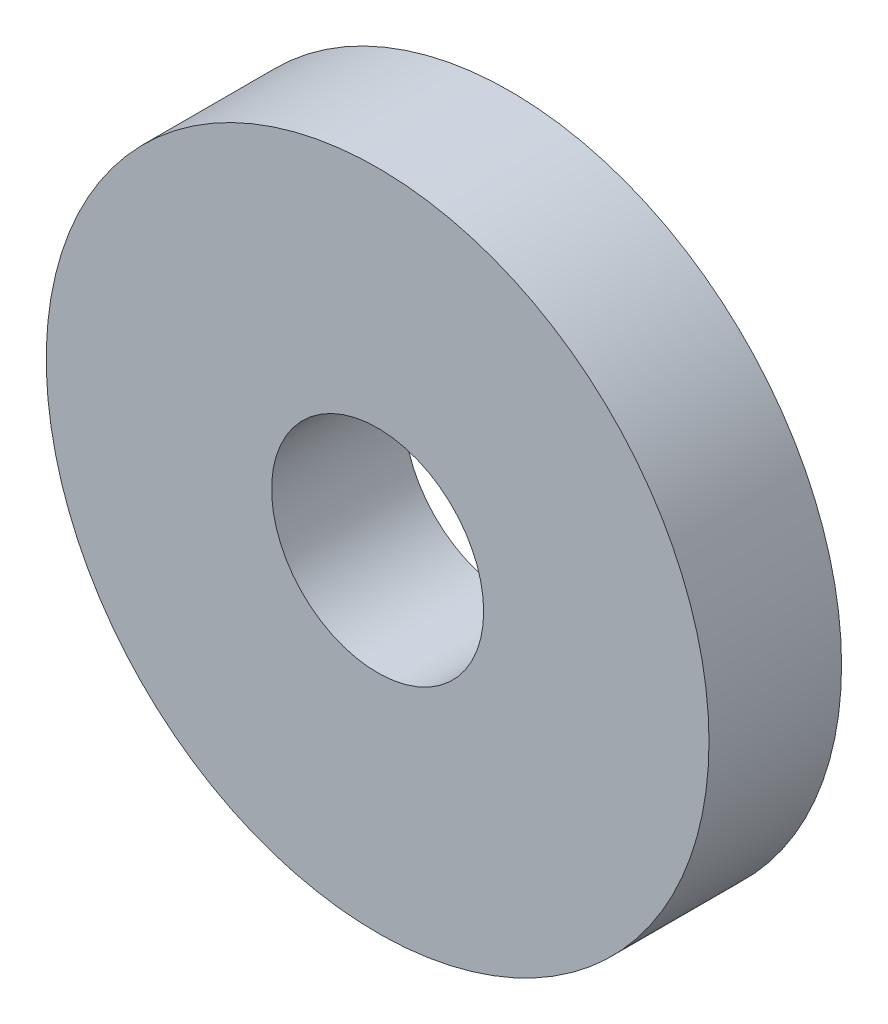
ISO-10303-21;
HEADER;
FILE_DESCRIPTION(('STEP AP214'),'2;1');
FILE_NAME('part.step','',(''),(''),'','','');
FILE_SCHEMA(('AUTOMOTIVE_DESIGN { 1 0 10303 214 1 1 1 1 }'));
ENDSEC;
DATA;
#1=APPLICATION_CONTEXT('core data for automotive mechanical design processes');
#2=APPLICATION_PROTOCOL_DEFINITION('international standard','automotive_design',2000,#1);
#3=PRODUCT_CONTEXT('',#1,'mechanical');
#4=PRODUCT('Part','Part','',(#3));
#5=PRODUCT_RELATED_PRODUCT_CATEGORY('part','',(#4));
#6=PRODUCT_DEFINITION_FORMATION('','',#4);
#7=PRODUCT_DEFINITION_CONTEXT('part definition',#1,'design');
#8=PRODUCT_DEFINITION('design','',#6,#7);
#9=PRODUCT_DEFINITION_SHAPE('','',#8);
#10=(LENGTH_UNIT() NAMED_UNIT(*) SI_UNIT(.MILLI.,.METRE.));
#11=(NAMED_UNIT(*) PLANE_ANGLE_UNIT() SI_UNIT($,.RADIAN.));
#12=(NAMED_UNIT(*) SI_UNIT($,.STERADIAN.) SOLID_ANGLE_UNIT());
#13=UNCERTAINTY_MEASURE_WITH_UNIT(LENGTH_MEASURE(1.E-05),#10,'distance_accuracy_value','');
#14=(GEOMETRIC_REPRESENTATION_CONTEXT(3) GLOBAL_UNCERTAINTY_ASSIGNED_CONTEXT((#13)) GLOBAL_UNIT_ASSIGNED_CONTEXT((#10,
#11,#12)) REPRESENTATION_CONTEXT('',''));
#15=CARTESIAN_POINT('',(0.,0.,0.));
#16=DIRECTION('',(0.,0.,1.));
#17=DIRECTION('',(1.,0.,0.));
#18=AXIS2_PLACEMENT_3D('',#15,#16,#17);
#19=CARTESIAN_POINT('',(0.,0.,5.));
#20=DIRECTION('',(0.,0.,1.));
#21=DIRECTION('',(1.,0.,0.));
#22=AXIS2_PLACEMENT_3D('',#19,#20,#21);
#23=PLANE('',#22);
#24=CARTESIAN_POINT('',(0.,0.,5.));
#25=DIRECTION('',(0.,0.,1.));
#26=DIRECTION('',(1.,0.,0.));
#27=AXIS2_PLACEMENT_3D('',#24,#25,#26);
#28=CIRCLE('',#27,12.5);
#29=CARTESIAN_POINT('',(12.5,0.,5.));
#30=VERTEX_POINT('',#29);
#31=EDGE_CURVE('E10',#30,#30,#28,.T.);
#32=ORIENTED_EDGE('',*,*,#31,.T.);
#33=EDGE_LOOP('',(#32));
#34=FACE_BOUND('',#33,.T.);
#35=CARTESIAN_POINT('',(0.,0.,5.));
#36=DIRECTION('',(0.,0.,1.));
#37=DIRECTION('',(1.,0.,0.));
#38=AXIS2_PLACEMENT_3D('',#35,#36,#37);
#39=CIRCLE('',#38,4.);
#40=CARTESIAN_POINT('',(4.,0.,5.));
#41=VERTEX_POINT('',#40);
#42=EDGE_CURVE('E48',#41,#41,#39,.T.);
#43=ORIENTED_EDGE('',*,*,#42,.F.);
#44=EDGE_LOOP('',(#43));
#45=FACE_BOUND('',#44,.T.);
#46=ADVANCED_FACE('F40',(#34,#45),#23,.T.);
#47=CARTESIAN_POINT('',(0.,0.,0.));
#48=DIRECTION('',(0.,0.,1.));
#49=DIRECTION('',(1.,0.,0.));
#50=AXIS2_PLACEMENT_3D('',#47,#48,#49);
#51=PLANE('',#50);
#52=CARTESIAN_POINT('',(0.,0.,0.));
#53=DIRECTION('',(0.,0.,1.));
#54=DIRECTION('',(1.,0.,0.));
#55=AXIS2_PLACEMENT_3D('',#52,#53,#54);
#56=CIRCLE('',#55,12.5);
#57=CARTESIAN_POINT('',(12.5,0.,0.));
#58=VERTEX_POINT('',#57);
#59=EDGE_CURVE('E41',#58,#58,#56,.T.);
#60=ORIENTED_EDGE('',*,*,#59,.F.);
#61=EDGE_LOOP('',(#60));
#62=FACE_BOUND('',#61,.T.);
#63=CARTESIAN_POINT('',(0.,0.,0.));
#64=DIRECTION('',(0.,0.,1.));
#65=DIRECTION('',(1.,0.,0.));
#66=AXIS2_PLACEMENT_3D('',#63,#64,#65);
#67=CIRCLE('',#66,4.);
#68=CARTESIAN_POINT('',(4.,0.,0.));
#69=VERTEX_POINT('',#68);
#70=EDGE_CURVE('E49',#69,#69,#67,.T.);
#71=ORIENTED_EDGE('',*,*,#70,.T.);
#72=EDGE_LOOP('',(#71));
#73=FACE_BOUND('',#72,.T.);
#74=ADVANCED_FACE('F58',(#62,#73),#51,.F.);
#75=CARTESIAN_POINT('',(0.,0.,5.));
#76=DIRECTION('',(0.,0.,-1.));
#77=DIRECTION('',(-1.,0.,0.));
#78=AXIS2_PLACEMENT_3D('',#75,#76,#77);
#79=CYLINDRICAL_SURFACE('',#78,12.5);
#80=ORIENTED_EDGE('',*,*,#31,.F.);
#81=EDGE_LOOP('',(#80));
#82=FACE_BOUND('',#81,.T.);
#83=ORIENTED_EDGE('',*,*,#59,.T.);
#84=EDGE_LOOP('',(#83));
#85=FACE_BOUND('',#84,.T.);
#86=ADVANCED_FACE('F39',(#82,#85),#79,.T.);
#87=CARTESIAN_POINT('',(0.,0.,5.));
#88=DIRECTION('',(0.,0.,-1.));
#89=DIRECTION('',(-1.,0.,0.));
#90=AXIS2_PLACEMENT_3D('',#87,#88,#89);
#91=CYLINDRICAL_SURFACE('',#90,4.);
#92=ORIENTED_EDGE('',*,*,#42,.T.);
#93=EDGE_LOOP('',(#92));
#94=FACE_BOUND('',#93,.T.);
#95=ORIENTED_EDGE('',*,*,#70,.F.);
#96=EDGE_LOOP('',(#95));
#97=FACE_BOUND('',#96,.T.);
#98=ADVANCED_FACE('F57',(#94,#97),#91,.F.);
#99=CLOSED_SHELL('',(#46,#74,#86,#98));
#100=MANIFOLD_SOLID_BREP('B2',#99);
#101=ADVANCED_BREP_SHAPE_REPRESENTATION('',(#18,#100),#14);
#102=SHAPE_DEFINITION_REPRESENTATION(#9,#101);
ENDSEC;
END-ISO-10303-21;
